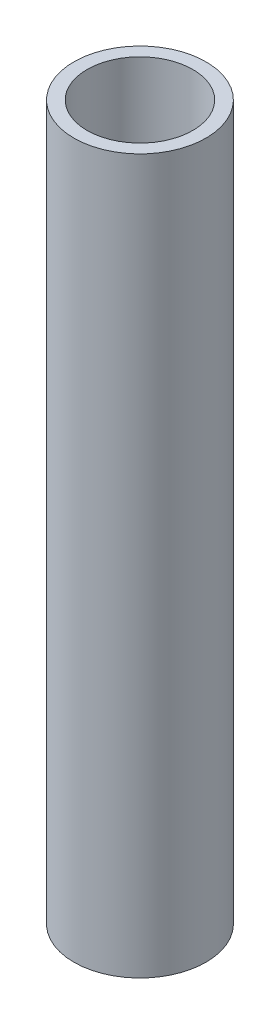
ISO-10303-21;
HEADER;
FILE_DESCRIPTION(('STEP AP214'),'2;1');
FILE_NAME('part.step','',(''),(''),'','','');
FILE_SCHEMA(('AUTOMOTIVE_DESIGN { 1 0 10303 214 1 1 1 1 }'));
ENDSEC;
DATA;
#1=APPLICATION_CONTEXT('core data for automotive mechanical design processes');
#2=APPLICATION_PROTOCOL_DEFINITION('international standard','automotive_design',2000,#1);
#3=PRODUCT_CONTEXT('',#1,'mechanical');
#4=PRODUCT('Part','Part','',(#3));
#5=PRODUCT_RELATED_PRODUCT_CATEGORY('part','',(#4));
#6=PRODUCT_DEFINITION_FORMATION('','',#4);
#7=PRODUCT_DEFINITION_CONTEXT('part definition',#1,'design');
#8=PRODUCT_DEFINITION('design','',#6,#7);
#9=PRODUCT_DEFINITION_SHAPE('','',#8);
#10=(LENGTH_UNIT() NAMED_UNIT(*) SI_UNIT(.MILLI.,.METRE.));
#11=(NAMED_UNIT(*) PLANE_ANGLE_UNIT() SI_UNIT($,.RADIAN.));
#12=(NAMED_UNIT(*) SI_UNIT($,.STERADIAN.) SOLID_ANGLE_UNIT());
#13=UNCERTAINTY_MEASURE_WITH_UNIT(LENGTH_MEASURE(1.E-05),#10,'distance_accuracy_value','');
#14=(GEOMETRIC_REPRESENTATION_CONTEXT(3) GLOBAL_UNCERTAINTY_ASSIGNED_CONTEXT((#13)) GLOBAL_UNIT_ASSIGNED_CONTEXT((#10,
#11,#12)) REPRESENTATION_CONTEXT('',''));
#15=CARTESIAN_POINT('',(0.,0.,0.));
#16=DIRECTION('',(0.,0.,1.));
#17=DIRECTION('',(1.,0.,0.));
#18=AXIS2_PLACEMENT_3D('',#15,#16,#17);
#19=CARTESIAN_POINT('',(0.,54.,0.));
#20=DIRECTION('',(0.,1.,0.));
#21=DIRECTION('',(0.,0.,1.));
#22=AXIS2_PLACEMENT_3D('',#19,#20,#21);
#23=PLANE('',#22);
#24=CARTESIAN_POINT('',(0.,54.,0.));
#25=DIRECTION('',(0.,1.,0.));
#26=DIRECTION('',(0.,0.,1.));
#27=AXIS2_PLACEMENT_3D('',#24,#25,#26);
#28=CIRCLE('',#27,5.);
#29=CARTESIAN_POINT('',(0.,54.,5.));
#30=VERTEX_POINT('',#29);
#31=EDGE_CURVE('E10',#30,#30,#28,.T.);
#32=ORIENTED_EDGE('',*,*,#31,.T.);
#33=EDGE_LOOP('',(#32));
#34=FACE_BOUND('',#33,.T.);
#35=CARTESIAN_POINT('',(0.,54.,0.));
#36=DIRECTION('',(0.,1.,0.));
#37=DIRECTION('',(0.,0.,1.));
#38=AXIS2_PLACEMENT_3D('',#35,#36,#37);
#39=CIRCLE('',#38,4.);
#40=CARTESIAN_POINT('',(0.,54.,4.));
#41=VERTEX_POINT('',#40);
#42=EDGE_CURVE('E44',#41,#41,#39,.T.);
#43=ORIENTED_EDGE('',*,*,#42,.F.);
#44=EDGE_LOOP('',(#43));
#45=FACE_BOUND('',#44,.T.);
#46=ADVANCED_FACE('F33',(#34,#45),#23,.T.);
#47=CARTESIAN_POINT('',(0.,0.,0.));
#48=DIRECTION('',(0.,1.,0.));
#49=DIRECTION('',(0.,0.,1.));
#50=AXIS2_PLACEMENT_3D('',#47,#48,#49);
#51=PLANE('',#50);
#52=CARTESIAN_POINT('',(0.,0.,0.));
#53=DIRECTION('',(0.,1.,0.));
#54=DIRECTION('',(0.,0.,1.));
#55=AXIS2_PLACEMENT_3D('',#52,#53,#54);
#56=CIRCLE('',#55,5.);
#57=CARTESIAN_POINT('',(0.,0.,5.));
#58=VERTEX_POINT('',#57);
#59=EDGE_CURVE('E37',#58,#58,#56,.T.);
#60=ORIENTED_EDGE('',*,*,#59,.F.);
#61=EDGE_LOOP('',(#60));
#62=FACE_BOUND('',#61,.T.);
#63=CARTESIAN_POINT('',(0.,0.,0.));
#64=DIRECTION('',(0.,1.,0.));
#65=DIRECTION('',(0.,0.,1.));
#66=AXIS2_PLACEMENT_3D('',#63,#64,#65);
#67=CIRCLE('',#66,4.);
#68=CARTESIAN_POINT('',(0.,0.,4.));
#69=VERTEX_POINT('',#68);
#70=EDGE_CURVE('E46',#69,#69,#67,.T.);
#71=ORIENTED_EDGE('',*,*,#70,.T.);
#72=EDGE_LOOP('',(#71));
#73=FACE_BOUND('',#72,.T.);
#74=ADVANCED_FACE('F56',(#62,#73),#51,.F.);
#75=CARTESIAN_POINT('',(0.,54.,0.));
#76=DIRECTION('',(0.,-1.,0.));
#77=DIRECTION('',(0.,0.,-1.));
#78=AXIS2_PLACEMENT_3D('',#75,#76,#77);
#79=CYLINDRICAL_SURFACE('',#78,5.);
#80=ORIENTED_EDGE('',*,*,#31,.F.);
#81=EDGE_LOOP('',(#80));
#82=FACE_BOUND('',#81,.T.);
#83=ORIENTED_EDGE('',*,*,#59,.T.);
#84=EDGE_LOOP('',(#83));
#85=FACE_BOUND('',#84,.T.);
#86=ADVANCED_FACE('F35',(#82,#85),#79,.T.);
#87=CARTESIAN_POINT('',(0.,54.,0.));
#88=DIRECTION('',(0.,-1.,0.));
#89=DIRECTION('',(0.,0.,-1.));
#90=AXIS2_PLACEMENT_3D('',#87,#88,#89);
#91=CYLINDRICAL_SURFACE('',#90,4.);
#92=ORIENTED_EDGE('',*,*,#42,.T.);
#93=EDGE_LOOP('',(#92));
#94=FACE_BOUND('',#93,.T.);
#95=ORIENTED_EDGE('',*,*,#70,.F.);
#96=EDGE_LOOP('',(#95));
#97=FACE_BOUND('',#96,.T.);
#98=ADVANCED_FACE('F52',(#94,#97),#91,.F.);
#99=CLOSED_SHELL('',(#46,#74,#86,#98));
#100=MANIFOLD_SOLID_BREP('B2',#99);
#101=ADVANCED_BREP_SHAPE_REPRESENTATION('',(#18,#100),#14);
#102=SHAPE_DEFINITION_REPRESENTATION(#9,#101);
ENDSEC;
END-ISO-10303-21;
